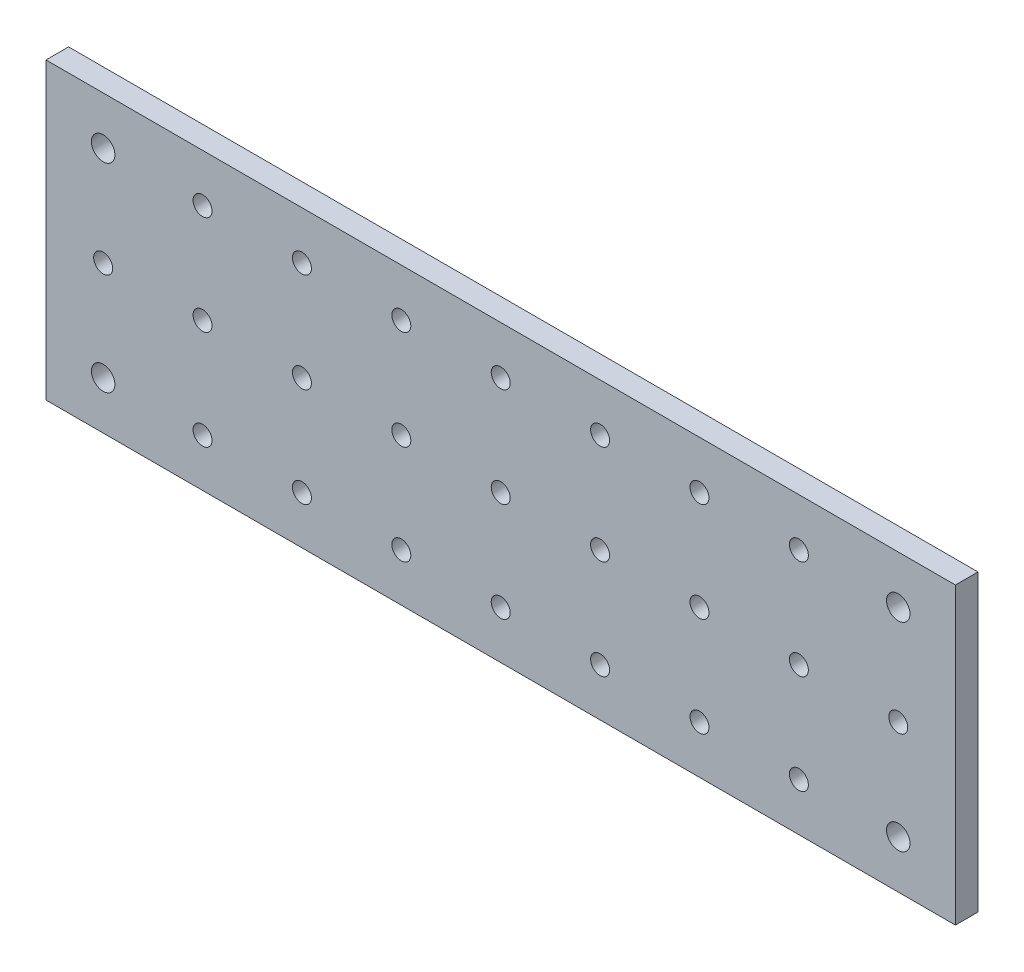
ISO-10303-21;
HEADER;
FILE_DESCRIPTION(('STEP AP214'),'2;1');
FILE_NAME('part.step','',(''),(''),'','','');
FILE_SCHEMA(('AUTOMOTIVE_DESIGN { 1 0 10303 214 1 1 1 1 }'));
ENDSEC;
DATA;
#1=APPLICATION_CONTEXT('core data for automotive mechanical design processes');
#2=APPLICATION_PROTOCOL_DEFINITION('international standard','automotive_design',2000,#1);
#3=PRODUCT_CONTEXT('',#1,'mechanical');
#4=PRODUCT('Part','Part','',(#3));
#5=PRODUCT_RELATED_PRODUCT_CATEGORY('part','',(#4));
#6=PRODUCT_DEFINITION_FORMATION('','',#4);
#7=PRODUCT_DEFINITION_CONTEXT('part definition',#1,'design');
#8=PRODUCT_DEFINITION('design','',#6,#7);
#9=PRODUCT_DEFINITION_SHAPE('','',#8);
#10=(LENGTH_UNIT() NAMED_UNIT(*) SI_UNIT(.MILLI.,.METRE.));
#11=(NAMED_UNIT(*) PLANE_ANGLE_UNIT() SI_UNIT($,.RADIAN.));
#12=(NAMED_UNIT(*) SI_UNIT($,.STERADIAN.) SOLID_ANGLE_UNIT());
#13=UNCERTAINTY_MEASURE_WITH_UNIT(LENGTH_MEASURE(1.E-05),#10,'distance_accuracy_value','');
#14=(GEOMETRIC_REPRESENTATION_CONTEXT(3) GLOBAL_UNCERTAINTY_ASSIGNED_CONTEXT((#13)) GLOBAL_UNIT_ASSIGNED_CONTEXT((#10,
#11,#12)) REPRESENTATION_CONTEXT('',''));
#15=CARTESIAN_POINT('',(0.,0.,0.));
#16=DIRECTION('',(0.,0.,1.));
#17=DIRECTION('',(1.,0.,0.));
#18=AXIS2_PLACEMENT_3D('',#15,#16,#17);
#19=CARTESIAN_POINT('',(0.,0.,5.));
#20=DIRECTION('',(0.,0.,-1.));
#21=DIRECTION('',(-1.,0.,0.));
#22=AXIS2_PLACEMENT_3D('',#19,#20,#21);
#23=PLANE('',#22);
#24=CARTESIAN_POINT('',(12.6500000000002,10.5999999999994,5.));
#25=DIRECTION('',(0.,0.,-1.));
#26=DIRECTION('',(-1.,0.,0.));
#27=AXIS2_PLACEMENT_3D('',#24,#25,#26);
#28=CIRCLE('',#27,2.6);
#29=CARTESIAN_POINT('',(10.0500000000002,10.5999999999994,5.));
#30=VERTEX_POINT('',#29);
#31=EDGE_CURVE('E116',#30,#30,#28,.F.);
#32=ORIENTED_EDGE('',*,*,#31,.F.);
#33=EDGE_LOOP('',(#32));
#34=FACE_BOUND('',#33,.T.);
#35=CARTESIAN_POINT('',(188.65,54.6,5.));
#36=DIRECTION('',(0.,0.,-1.));
#37=DIRECTION('',(-1.,0.,0.));
#38=AXIS2_PLACEMENT_3D('',#35,#36,#37);
#39=CIRCLE('',#38,2.59999999999999);
#40=CARTESIAN_POINT('',(186.05,54.6,5.));
#41=VERTEX_POINT('',#40);
#42=EDGE_CURVE('E112',#41,#41,#39,.F.);
#43=ORIENTED_EDGE('',*,*,#42,.F.);
#44=EDGE_LOOP('',(#43));
#45=FACE_BOUND('',#44,.T.);
#46=CARTESIAN_POINT('',(34.6500000000002,10.5999999999995,5.));
#47=DIRECTION('',(0.,0.,-1.));
#48=DIRECTION('',(-1.,0.,0.));
#49=AXIS2_PLACEMENT_3D('',#46,#47,#48);
#50=CIRCLE('',#49,2.1);
#51=CARTESIAN_POINT('',(32.5500000000002,10.5999999999995,5.));
#52=VERTEX_POINT('',#51);
#53=EDGE_CURVE('E143',#52,#52,#50,.F.);
#54=ORIENTED_EDGE('',*,*,#53,.F.);
#55=EDGE_LOOP('',(#54));
#56=FACE_BOUND('',#55,.T.);
#57=CARTESIAN_POINT('',(34.65,32.5999999999995,5.));
#58=DIRECTION('',(0.,0.,-1.));
#59=DIRECTION('',(-1.,0.,0.));
#60=AXIS2_PLACEMENT_3D('',#57,#58,#59);
#61=CIRCLE('',#60,2.1);
#62=CARTESIAN_POINT('',(32.55,32.5999999999995,5.));
#63=VERTEX_POINT('',#62);
#64=EDGE_CURVE('E155',#63,#63,#61,.F.);
#65=ORIENTED_EDGE('',*,*,#64,.F.);
#66=EDGE_LOOP('',(#65));
#67=FACE_BOUND('',#66,.T.);
#68=CARTESIAN_POINT('',(56.6499999999999,54.5999999999997,5.));
#69=DIRECTION('',(0.,0.,-1.));
#70=DIRECTION('',(-1.,0.,0.));
#71=AXIS2_PLACEMENT_3D('',#68,#69,#70);
#72=CIRCLE('',#71,2.1);
#73=CARTESIAN_POINT('',(54.5499999999999,54.5999999999997,5.));
#74=VERTEX_POINT('',#73);
#75=EDGE_CURVE('E167',#74,#74,#72,.F.);
#76=ORIENTED_EDGE('',*,*,#75,.F.);
#77=EDGE_LOOP('',(#76));
#78=FACE_BOUND('',#77,.T.);
#79=CARTESIAN_POINT('',(78.6500000000002,10.5999999999999,5.));
#80=DIRECTION('',(0.,0.,-1.));
#81=DIRECTION('',(-1.,0.,0.));
#82=AXIS2_PLACEMENT_3D('',#79,#80,#81);
#83=CIRCLE('',#82,2.09999999999999);
#84=CARTESIAN_POINT('',(76.5500000000003,10.5999999999999,5.));
#85=VERTEX_POINT('',#84);
#86=EDGE_CURVE('E179',#85,#85,#83,.F.);
#87=ORIENTED_EDGE('',*,*,#86,.F.);
#88=EDGE_LOOP('',(#87));
#89=FACE_BOUND('',#88,.T.);
#90=CARTESIAN_POINT('',(78.65,32.5999999999999,5.));
#91=DIRECTION('',(0.,0.,-1.));
#92=DIRECTION('',(-1.,0.,0.));
#93=AXIS2_PLACEMENT_3D('',#90,#91,#92);
#94=CIRCLE('',#93,2.10000000000002);
#95=CARTESIAN_POINT('',(76.55,32.5999999999999,5.));
#96=VERTEX_POINT('',#95);
#97=EDGE_CURVE('E191',#96,#96,#94,.F.);
#98=ORIENTED_EDGE('',*,*,#97,.F.);
#99=EDGE_LOOP('',(#98));
#100=FACE_BOUND('',#99,.T.);
#101=CARTESIAN_POINT('',(166.65,10.6,5.));
#102=DIRECTION('',(0.,0.,-1.));
#103=DIRECTION('',(-1.,0.,0.));
#104=AXIS2_PLACEMENT_3D('',#101,#102,#103);
#105=CIRCLE('',#104,2.09999999999999);
#106=CARTESIAN_POINT('',(164.55,10.6,5.));
#107=VERTEX_POINT('',#106);
#108=EDGE_CURVE('E203',#107,#107,#105,.F.);
#109=ORIENTED_EDGE('',*,*,#108,.F.);
#110=EDGE_LOOP('',(#109));
#111=FACE_BOUND('',#110,.T.);
#112=CARTESIAN_POINT('',(166.65,32.6,5.));
#113=DIRECTION('',(0.,0.,-1.));
#114=DIRECTION('',(-1.,0.,0.));
#115=AXIS2_PLACEMENT_3D('',#112,#113,#114);
#116=CIRCLE('',#115,2.09999999999999);
#117=CARTESIAN_POINT('',(164.55,32.6,5.));
#118=VERTEX_POINT('',#117);
#119=EDGE_CURVE('E215',#118,#118,#116,.F.);
#120=ORIENTED_EDGE('',*,*,#119,.F.);
#121=EDGE_LOOP('',(#120));
#122=FACE_BOUND('',#121,.T.);
#123=CARTESIAN_POINT('',(144.65,54.6,5.));
#124=DIRECTION('',(0.,0.,-1.));
#125=DIRECTION('',(-1.,0.,0.));
#126=AXIS2_PLACEMENT_3D('',#123,#124,#125);
#127=CIRCLE('',#126,2.10000000000002);
#128=CARTESIAN_POINT('',(142.55,54.6,5.));
#129=VERTEX_POINT('',#128);
#130=EDGE_CURVE('E227',#129,#129,#127,.F.);
#131=ORIENTED_EDGE('',*,*,#130,.F.);
#132=EDGE_LOOP('',(#131));
#133=FACE_BOUND('',#132,.T.);
#134=CARTESIAN_POINT('',(122.65,10.6,5.));
#135=DIRECTION('',(0.,0.,-1.));
#136=DIRECTION('',(-1.,0.,0.));
#137=AXIS2_PLACEMENT_3D('',#134,#135,#136);
#138=CIRCLE('',#137,2.10000000000002);
#139=CARTESIAN_POINT('',(120.55,10.6,5.));
#140=VERTEX_POINT('',#139);
#141=EDGE_CURVE('E239',#140,#140,#138,.F.);
#142=ORIENTED_EDGE('',*,*,#141,.F.);
#143=EDGE_LOOP('',(#142));
#144=FACE_BOUND('',#143,.T.);
#145=CARTESIAN_POINT('',(122.65,32.6,5.));
#146=DIRECTION('',(0.,0.,-1.));
#147=DIRECTION('',(-1.,0.,0.));
#148=AXIS2_PLACEMENT_3D('',#145,#146,#147);
#149=CIRCLE('',#148,2.09999999999999);
#150=CARTESIAN_POINT('',(120.55,32.6,5.));
#151=VERTEX_POINT('',#150);
#152=EDGE_CURVE('E251',#151,#151,#149,.F.);
#153=ORIENTED_EDGE('',*,*,#152,.F.);
#154=EDGE_LOOP('',(#153));
#155=FACE_BOUND('',#154,.T.);
#156=CARTESIAN_POINT('',(100.65,54.6,5.));
#157=DIRECTION('',(0.,0.,-1.));
#158=DIRECTION('',(-1.,0.,0.));
#159=AXIS2_PLACEMENT_3D('',#156,#157,#158);
#160=CIRCLE('',#159,2.1);
#161=CARTESIAN_POINT('',(98.5499999999999,54.6,5.));
#162=VERTEX_POINT('',#161);
#163=EDGE_CURVE('E263',#162,#162,#160,.F.);
#164=ORIENTED_EDGE('',*,*,#163,.F.);
#165=EDGE_LOOP('',(#164));
#166=FACE_BOUND('',#165,.T.);
#167=DIRECTION('',(0.,-1.,0.));
#168=VECTOR('',#167,1.);
#169=CARTESIAN_POINT('',(0.,0.,5.));
#170=LINE('',#169,#168);
#171=CARTESIAN_POINT('',(0.,65.2,5.));
#172=VERTEX_POINT('',#171);
#173=CARTESIAN_POINT('',(0.,0.,5.));
#174=VERTEX_POINT('',#173);
#175=EDGE_CURVE('E87',#172,#174,#170,.T.);
#176=ORIENTED_EDGE('',*,*,#175,.T.);
#177=DIRECTION('',(1.,0.,0.));
#178=VECTOR('',#177,1.);
#179=CARTESIAN_POINT('',(0.,0.,5.));
#180=LINE('',#179,#178);
#181=CARTESIAN_POINT('',(201.3,0.,5.));
#182=VERTEX_POINT('',#181);
#183=EDGE_CURVE('E82',#174,#182,#180,.T.);
#184=ORIENTED_EDGE('',*,*,#183,.T.);
#185=DIRECTION('',(0.,1.,0.));
#186=VECTOR('',#185,1.);
#187=CARTESIAN_POINT('',(201.3,0.,5.));
#188=LINE('',#187,#186);
#189=CARTESIAN_POINT('',(201.3,65.2,5.));
#190=VERTEX_POINT('',#189);
#191=EDGE_CURVE('E85',#182,#190,#188,.T.);
#192=ORIENTED_EDGE('',*,*,#191,.T.);
#193=DIRECTION('',(-1.,0.,0.));
#194=VECTOR('',#193,1.);
#195=CARTESIAN_POINT('',(0.,65.2,5.));
#196=LINE('',#195,#194);
#197=EDGE_CURVE('E52',#190,#172,#196,.T.);
#198=ORIENTED_EDGE('',*,*,#197,.T.);
#199=EDGE_LOOP('',(#176,#184,#192,#198));
#200=FACE_BOUND('',#199,.T.);
#201=CARTESIAN_POINT('',(100.65,32.6,5.));
#202=DIRECTION('',(0.,0.,-1.));
#203=DIRECTION('',(-1.,0.,0.));
#204=AXIS2_PLACEMENT_3D('',#201,#202,#203);
#205=CIRCLE('',#204,2.1);
#206=CARTESIAN_POINT('',(98.55,32.6,5.));
#207=VERTEX_POINT('',#206);
#208=EDGE_CURVE('E103',#207,#207,#205,.F.);
#209=ORIENTED_EDGE('',*,*,#208,.F.);
#210=EDGE_LOOP('',(#209));
#211=FACE_BOUND('',#210,.T.);
#212=CARTESIAN_POINT('',(100.65,10.6,5.));
#213=DIRECTION('',(0.,0.,-1.));
#214=DIRECTION('',(-1.,0.,0.));
#215=AXIS2_PLACEMENT_3D('',#212,#213,#214);
#216=CIRCLE('',#215,2.1);
#217=CARTESIAN_POINT('',(98.5500000000002,10.6,5.));
#218=VERTEX_POINT('',#217);
#219=EDGE_CURVE('E257',#218,#218,#216,.F.);
#220=ORIENTED_EDGE('',*,*,#219,.F.);
#221=EDGE_LOOP('',(#220));
#222=FACE_BOUND('',#221,.T.);
#223=CARTESIAN_POINT('',(122.65,54.6,5.));
#224=DIRECTION('',(0.,0.,-1.));
#225=DIRECTION('',(-1.,0.,0.));
#226=AXIS2_PLACEMENT_3D('',#223,#224,#225);
#227=CIRCLE('',#226,2.09999999999999);
#228=CARTESIAN_POINT('',(120.55,54.6,5.));
#229=VERTEX_POINT('',#228);
#230=EDGE_CURVE('E245',#229,#229,#227,.F.);
#231=ORIENTED_EDGE('',*,*,#230,.F.);
#232=EDGE_LOOP('',(#231));
#233=FACE_BOUND('',#232,.T.);
#234=CARTESIAN_POINT('',(144.65,32.6,5.));
#235=DIRECTION('',(0.,0.,-1.));
#236=DIRECTION('',(-1.,0.,0.));
#237=AXIS2_PLACEMENT_3D('',#234,#235,#236);
#238=CIRCLE('',#237,2.09999999999999);
#239=CARTESIAN_POINT('',(142.55,32.6,5.));
#240=VERTEX_POINT('',#239);
#241=EDGE_CURVE('E233',#240,#240,#238,.F.);
#242=ORIENTED_EDGE('',*,*,#241,.F.);
#243=EDGE_LOOP('',(#242));
#244=FACE_BOUND('',#243,.T.);
#245=CARTESIAN_POINT('',(144.65,10.6,5.));
#246=DIRECTION('',(0.,0.,-1.));
#247=DIRECTION('',(-1.,0.,0.));
#248=AXIS2_PLACEMENT_3D('',#245,#246,#247);
#249=CIRCLE('',#248,2.10000000000002);
#250=CARTESIAN_POINT('',(142.55,10.6,5.));
#251=VERTEX_POINT('',#250);
#252=EDGE_CURVE('E221',#251,#251,#249,.F.);
#253=ORIENTED_EDGE('',*,*,#252,.F.);
#254=EDGE_LOOP('',(#253));
#255=FACE_BOUND('',#254,.T.);
#256=CARTESIAN_POINT('',(166.65,54.6,5.));
#257=DIRECTION('',(0.,0.,-1.));
#258=DIRECTION('',(-1.,0.,0.));
#259=AXIS2_PLACEMENT_3D('',#256,#257,#258);
#260=CIRCLE('',#259,2.10000000000002);
#261=CARTESIAN_POINT('',(164.55,54.6,5.));
#262=VERTEX_POINT('',#261);
#263=EDGE_CURVE('E209',#262,#262,#260,.F.);
#264=ORIENTED_EDGE('',*,*,#263,.F.);
#265=EDGE_LOOP('',(#264));
#266=FACE_BOUND('',#265,.T.);
#267=CARTESIAN_POINT('',(188.65,32.6,5.));
#268=DIRECTION('',(0.,0.,-1.));
#269=DIRECTION('',(-1.,0.,0.));
#270=AXIS2_PLACEMENT_3D('',#267,#268,#269);
#271=CIRCLE('',#270,2.10000000000002);
#272=CARTESIAN_POINT('',(186.55,32.6,5.));
#273=VERTEX_POINT('',#272);
#274=EDGE_CURVE('E197',#273,#273,#271,.F.);
#275=ORIENTED_EDGE('',*,*,#274,.F.);
#276=EDGE_LOOP('',(#275));
#277=FACE_BOUND('',#276,.T.);
#278=CARTESIAN_POINT('',(78.6499999999999,54.5999999999999,5.));
#279=DIRECTION('',(0.,0.,-1.));
#280=DIRECTION('',(-1.,0.,0.));
#281=AXIS2_PLACEMENT_3D('',#278,#279,#280);
#282=CIRCLE('',#281,2.10000000000002);
#283=CARTESIAN_POINT('',(76.5499999999999,54.5999999999999,5.));
#284=VERTEX_POINT('',#283);
#285=EDGE_CURVE('E185',#284,#284,#282,.F.);
#286=ORIENTED_EDGE('',*,*,#285,.F.);
#287=EDGE_LOOP('',(#286));
#288=FACE_BOUND('',#287,.T.);
#289=CARTESIAN_POINT('',(56.65,32.5999999999997,5.));
#290=DIRECTION('',(0.,0.,-1.));
#291=DIRECTION('',(-1.,0.,0.));
#292=AXIS2_PLACEMENT_3D('',#289,#290,#291);
#293=CIRCLE('',#292,2.1);
#294=CARTESIAN_POINT('',(54.55,32.5999999999997,5.));
#295=VERTEX_POINT('',#294);
#296=EDGE_CURVE('E173',#295,#295,#293,.F.);
#297=ORIENTED_EDGE('',*,*,#296,.F.);
#298=EDGE_LOOP('',(#297));
#299=FACE_BOUND('',#298,.T.);
#300=CARTESIAN_POINT('',(56.6500000000002,10.5999999999997,5.));
#301=DIRECTION('',(0.,0.,-1.));
#302=DIRECTION('',(-1.,0.,0.));
#303=AXIS2_PLACEMENT_3D('',#300,#301,#302);
#304=CIRCLE('',#303,2.1);
#305=CARTESIAN_POINT('',(54.5500000000002,10.5999999999997,5.));
#306=VERTEX_POINT('',#305);
#307=EDGE_CURVE('E161',#306,#306,#304,.F.);
#308=ORIENTED_EDGE('',*,*,#307,.F.);
#309=EDGE_LOOP('',(#308));
#310=FACE_BOUND('',#309,.T.);
#311=CARTESIAN_POINT('',(34.6499999999999,54.5999999999995,5.));
#312=DIRECTION('',(0.,0.,-1.));
#313=DIRECTION('',(-1.,0.,0.));
#314=AXIS2_PLACEMENT_3D('',#311,#312,#313);
#315=CIRCLE('',#314,2.1);
#316=CARTESIAN_POINT('',(32.5499999999999,54.5999999999995,5.));
#317=VERTEX_POINT('',#316);
#318=EDGE_CURVE('E149',#317,#317,#315,.F.);
#319=ORIENTED_EDGE('',*,*,#318,.F.);
#320=EDGE_LOOP('',(#319));
#321=FACE_BOUND('',#320,.T.);
#322=CARTESIAN_POINT('',(12.65,32.5999999999994,5.));
#323=DIRECTION('',(0.,0.,-1.));
#324=DIRECTION('',(-1.,0.,0.));
#325=AXIS2_PLACEMENT_3D('',#322,#323,#324);
#326=CIRCLE('',#325,2.1);
#327=CARTESIAN_POINT('',(10.55,32.5999999999994,5.));
#328=VERTEX_POINT('',#327);
#329=EDGE_CURVE('E137',#328,#328,#326,.F.);
#330=ORIENTED_EDGE('',*,*,#329,.F.);
#331=EDGE_LOOP('',(#330));
#332=FACE_BOUND('',#331,.T.);
#333=CARTESIAN_POINT('',(12.6500000000006,54.5999999999997,5.));
#334=DIRECTION('',(0.,0.,-1.));
#335=DIRECTION('',(-1.,0.,0.));
#336=AXIS2_PLACEMENT_3D('',#333,#334,#335);
#337=CIRCLE('',#336,2.6);
#338=CARTESIAN_POINT('',(10.0500000000006,54.5999999999997,5.));
#339=VERTEX_POINT('',#338);
#340=EDGE_CURVE('E113',#339,#339,#337,.F.);
#341=ORIENTED_EDGE('',*,*,#340,.F.);
#342=EDGE_LOOP('',(#341));
#343=FACE_BOUND('',#342,.T.);
#344=CARTESIAN_POINT('',(188.65,10.6,5.));
#345=DIRECTION('',(0.,0.,-1.));
#346=DIRECTION('',(-1.,0.,0.));
#347=AXIS2_PLACEMENT_3D('',#344,#345,#346);
#348=CIRCLE('',#347,2.59999999999999);
#349=CARTESIAN_POINT('',(186.05,10.6,5.));
#350=VERTEX_POINT('',#349);
#351=EDGE_CURVE('E119',#350,#350,#348,.F.);
#352=ORIENTED_EDGE('',*,*,#351,.F.);
#353=EDGE_LOOP('',(#352));
#354=FACE_BOUND('',#353,.T.);
#355=ADVANCED_FACE('F33',(#34,#45,#56,#67,#78,#89,#100,#111,#122,#133,#144,#155,#166,#200,#211,
#222,#233,#244,#255,#266,#277,#288,#299,#310,#321,#332,#343,#354),#23,.F.);
#356=CARTESIAN_POINT('',(0.,0.,0.));
#357=DIRECTION('',(0.,0.,-1.));
#358=DIRECTION('',(-1.,0.,0.));
#359=AXIS2_PLACEMENT_3D('',#356,#357,#358);
#360=PLANE('',#359);
#361=CARTESIAN_POINT('',(12.6500000000002,10.5999999999994,0.));
#362=DIRECTION('',(0.,0.,-1.));
#363=DIRECTION('',(-1.,0.,0.));
#364=AXIS2_PLACEMENT_3D('',#361,#362,#363);
#365=CIRCLE('',#364,2.6);
#366=CARTESIAN_POINT('',(10.0500000000002,10.5999999999994,0.));
#367=VERTEX_POINT('',#366);
#368=EDGE_CURVE('E117',#367,#367,#365,.F.);
#369=ORIENTED_EDGE('',*,*,#368,.T.);
#370=EDGE_LOOP('',(#369));
#371=FACE_BOUND('',#370,.T.);
#372=CARTESIAN_POINT('',(188.65,54.6,0.));
#373=DIRECTION('',(0.,0.,-1.));
#374=DIRECTION('',(-1.,0.,0.));
#375=AXIS2_PLACEMENT_3D('',#372,#373,#374);
#376=CIRCLE('',#375,2.59999999999999);
#377=CARTESIAN_POINT('',(186.05,54.6,0.));
#378=VERTEX_POINT('',#377);
#379=EDGE_CURVE('E109',#378,#378,#376,.F.);
#380=ORIENTED_EDGE('',*,*,#379,.T.);
#381=EDGE_LOOP('',(#380));
#382=FACE_BOUND('',#381,.T.);
#383=CARTESIAN_POINT('',(34.6500000000002,10.5999999999995,0.));
#384=DIRECTION('',(0.,0.,1.));
#385=DIRECTION('',(1.,0.,0.));
#386=AXIS2_PLACEMENT_3D('',#383,#384,#385);
#387=CIRCLE('',#386,2.1);
#388=CARTESIAN_POINT('',(36.7500000000002,10.5999999999995,0.));
#389=VERTEX_POINT('',#388);
#390=EDGE_CURVE('E140',#389,#389,#387,.T.);
#391=ORIENTED_EDGE('',*,*,#390,.T.);
#392=EDGE_LOOP('',(#391));
#393=FACE_BOUND('',#392,.T.);
#394=CARTESIAN_POINT('',(34.65,32.5999999999995,0.));
#395=DIRECTION('',(0.,0.,1.));
#396=DIRECTION('',(1.,0.,0.));
#397=AXIS2_PLACEMENT_3D('',#394,#395,#396);
#398=CIRCLE('',#397,2.1);
#399=CARTESIAN_POINT('',(36.75,32.5999999999995,0.));
#400=VERTEX_POINT('',#399);
#401=EDGE_CURVE('E152',#400,#400,#398,.T.);
#402=ORIENTED_EDGE('',*,*,#401,.T.);
#403=EDGE_LOOP('',(#402));
#404=FACE_BOUND('',#403,.T.);
#405=CARTESIAN_POINT('',(56.6499999999999,54.5999999999997,0.));
#406=DIRECTION('',(0.,0.,1.));
#407=DIRECTION('',(1.,0.,0.));
#408=AXIS2_PLACEMENT_3D('',#405,#406,#407);
#409=CIRCLE('',#408,2.1);
#410=CARTESIAN_POINT('',(58.7499999999999,54.5999999999997,0.));
#411=VERTEX_POINT('',#410);
#412=EDGE_CURVE('E164',#411,#411,#409,.T.);
#413=ORIENTED_EDGE('',*,*,#412,.T.);
#414=EDGE_LOOP('',(#413));
#415=FACE_BOUND('',#414,.T.);
#416=CARTESIAN_POINT('',(78.6500000000002,10.5999999999999,0.));
#417=DIRECTION('',(0.,0.,1.));
#418=DIRECTION('',(1.,0.,0.));
#419=AXIS2_PLACEMENT_3D('',#416,#417,#418);
#420=CIRCLE('',#419,2.09999999999999);
#421=CARTESIAN_POINT('',(80.7500000000002,10.5999999999999,0.));
#422=VERTEX_POINT('',#421);
#423=EDGE_CURVE('E176',#422,#422,#420,.T.);
#424=ORIENTED_EDGE('',*,*,#423,.T.);
#425=EDGE_LOOP('',(#424));
#426=FACE_BOUND('',#425,.T.);
#427=CARTESIAN_POINT('',(78.65,32.5999999999999,0.));
#428=DIRECTION('',(0.,0.,1.));
#429=DIRECTION('',(1.,0.,0.));
#430=AXIS2_PLACEMENT_3D('',#427,#428,#429);
#431=CIRCLE('',#430,2.10000000000002);
#432=CARTESIAN_POINT('',(80.75,32.5999999999999,0.));
#433=VERTEX_POINT('',#432);
#434=EDGE_CURVE('E188',#433,#433,#431,.T.);
#435=ORIENTED_EDGE('',*,*,#434,.T.);
#436=EDGE_LOOP('',(#435));
#437=FACE_BOUND('',#436,.T.);
#438=CARTESIAN_POINT('',(166.65,10.6,0.));
#439=DIRECTION('',(0.,0.,1.));
#440=DIRECTION('',(1.,0.,0.));
#441=AXIS2_PLACEMENT_3D('',#438,#439,#440);
#442=CIRCLE('',#441,2.09999999999999);
#443=CARTESIAN_POINT('',(168.75,10.6,0.));
#444=VERTEX_POINT('',#443);
#445=EDGE_CURVE('E200',#444,#444,#442,.T.);
#446=ORIENTED_EDGE('',*,*,#445,.T.);
#447=EDGE_LOOP('',(#446));
#448=FACE_BOUND('',#447,.T.);
#449=CARTESIAN_POINT('',(166.65,32.6,0.));
#450=DIRECTION('',(0.,0.,1.));
#451=DIRECTION('',(1.,0.,0.));
#452=AXIS2_PLACEMENT_3D('',#449,#450,#451);
#453=CIRCLE('',#452,2.09999999999999);
#454=CARTESIAN_POINT('',(168.75,32.6,0.));
#455=VERTEX_POINT('',#454);
#456=EDGE_CURVE('E212',#455,#455,#453,.T.);
#457=ORIENTED_EDGE('',*,*,#456,.T.);
#458=EDGE_LOOP('',(#457));
#459=FACE_BOUND('',#458,.T.);
#460=CARTESIAN_POINT('',(144.65,54.6,0.));
#461=DIRECTION('',(0.,0.,1.));
#462=DIRECTION('',(1.,0.,0.));
#463=AXIS2_PLACEMENT_3D('',#460,#461,#462);
#464=CIRCLE('',#463,2.10000000000002);
#465=CARTESIAN_POINT('',(146.75,54.6,0.));
#466=VERTEX_POINT('',#465);
#467=EDGE_CURVE('E224',#466,#466,#464,.T.);
#468=ORIENTED_EDGE('',*,*,#467,.T.);
#469=EDGE_LOOP('',(#468));
#470=FACE_BOUND('',#469,.T.);
#471=CARTESIAN_POINT('',(122.65,10.6,0.));
#472=DIRECTION('',(0.,0.,1.));
#473=DIRECTION('',(1.,0.,0.));
#474=AXIS2_PLACEMENT_3D('',#471,#472,#473);
#475=CIRCLE('',#474,2.10000000000002);
#476=CARTESIAN_POINT('',(124.75,10.6,0.));
#477=VERTEX_POINT('',#476);
#478=EDGE_CURVE('E236',#477,#477,#475,.T.);
#479=ORIENTED_EDGE('',*,*,#478,.T.);
#480=EDGE_LOOP('',(#479));
#481=FACE_BOUND('',#480,.T.);
#482=CARTESIAN_POINT('',(122.65,32.6,0.));
#483=DIRECTION('',(0.,0.,1.));
#484=DIRECTION('',(1.,0.,0.));
#485=AXIS2_PLACEMENT_3D('',#482,#483,#484);
#486=CIRCLE('',#485,2.09999999999999);
#487=CARTESIAN_POINT('',(124.75,32.6,0.));
#488=VERTEX_POINT('',#487);
#489=EDGE_CURVE('E248',#488,#488,#486,.T.);
#490=ORIENTED_EDGE('',*,*,#489,.T.);
#491=EDGE_LOOP('',(#490));
#492=FACE_BOUND('',#491,.T.);
#493=CARTESIAN_POINT('',(100.65,54.6,0.));
#494=DIRECTION('',(0.,0.,1.));
#495=DIRECTION('',(1.,0.,0.));
#496=AXIS2_PLACEMENT_3D('',#493,#494,#495);
#497=CIRCLE('',#496,2.1);
#498=CARTESIAN_POINT('',(102.75,54.6,0.));
#499=VERTEX_POINT('',#498);
#500=EDGE_CURVE('E260',#499,#499,#497,.T.);
#501=ORIENTED_EDGE('',*,*,#500,.T.);
#502=EDGE_LOOP('',(#501));
#503=FACE_BOUND('',#502,.T.);
#504=DIRECTION('',(0.,-1.,0.));
#505=VECTOR('',#504,1.);
#506=CARTESIAN_POINT('',(0.,0.,0.));
#507=LINE('',#506,#505);
#508=CARTESIAN_POINT('',(0.,65.2,0.));
#509=VERTEX_POINT('',#508);
#510=CARTESIAN_POINT('',(0.,0.,0.));
#511=VERTEX_POINT('',#510);
#512=EDGE_CURVE('E100',#509,#511,#507,.T.);
#513=ORIENTED_EDGE('',*,*,#512,.F.);
#514=DIRECTION('',(-1.,0.,0.));
#515=VECTOR('',#514,1.);
#516=CARTESIAN_POINT('',(0.,65.2,0.));
#517=LINE('',#516,#515);
#518=CARTESIAN_POINT('',(201.3,65.2,0.));
#519=VERTEX_POINT('',#518);
#520=EDGE_CURVE('E75',#519,#509,#517,.T.);
#521=ORIENTED_EDGE('',*,*,#520,.F.);
#522=DIRECTION('',(0.,1.,0.));
#523=VECTOR('',#522,1.);
#524=CARTESIAN_POINT('',(201.3,0.,0.));
#525=LINE('',#524,#523);
#526=CARTESIAN_POINT('',(201.3,0.,0.));
#527=VERTEX_POINT('',#526);
#528=EDGE_CURVE('E69',#527,#519,#525,.T.);
#529=ORIENTED_EDGE('',*,*,#528,.F.);
#530=DIRECTION('',(1.,0.,0.));
#531=VECTOR('',#530,1.);
#532=CARTESIAN_POINT('',(0.,0.,0.));
#533=LINE('',#532,#531);
#534=EDGE_CURVE('E91',#511,#527,#533,.T.);
#535=ORIENTED_EDGE('',*,*,#534,.F.);
#536=EDGE_LOOP('',(#513,#521,#529,#535));
#537=FACE_BOUND('',#536,.T.);
#538=CARTESIAN_POINT('',(100.65,32.6,0.));
#539=DIRECTION('',(0.,0.,1.));
#540=DIRECTION('',(1.,0.,0.));
#541=AXIS2_PLACEMENT_3D('',#538,#539,#540);
#542=CIRCLE('',#541,2.1);
#543=CARTESIAN_POINT('',(102.75,32.6,0.));
#544=VERTEX_POINT('',#543);
#545=EDGE_CURVE('E266',#544,#544,#542,.T.);
#546=ORIENTED_EDGE('',*,*,#545,.T.);
#547=EDGE_LOOP('',(#546));
#548=FACE_BOUND('',#547,.T.);
#549=CARTESIAN_POINT('',(100.65,10.6,0.));
#550=DIRECTION('',(0.,0.,1.));
#551=DIRECTION('',(1.,0.,0.));
#552=AXIS2_PLACEMENT_3D('',#549,#550,#551);
#553=CIRCLE('',#552,2.1);
#554=CARTESIAN_POINT('',(102.75,10.6,0.));
#555=VERTEX_POINT('',#554);
#556=EDGE_CURVE('E254',#555,#555,#553,.T.);
#557=ORIENTED_EDGE('',*,*,#556,.T.);
#558=EDGE_LOOP('',(#557));
#559=FACE_BOUND('',#558,.T.);
#560=CARTESIAN_POINT('',(122.65,54.6,0.));
#561=DIRECTION('',(0.,0.,1.));
#562=DIRECTION('',(1.,0.,0.));
#563=AXIS2_PLACEMENT_3D('',#560,#561,#562);
#564=CIRCLE('',#563,2.09999999999999);
#565=CARTESIAN_POINT('',(124.75,54.6,0.));
#566=VERTEX_POINT('',#565);
#567=EDGE_CURVE('E242',#566,#566,#564,.T.);
#568=ORIENTED_EDGE('',*,*,#567,.T.);
#569=EDGE_LOOP('',(#568));
#570=FACE_BOUND('',#569,.T.);
#571=CARTESIAN_POINT('',(144.65,32.6,0.));
#572=DIRECTION('',(0.,0.,1.));
#573=DIRECTION('',(1.,0.,0.));
#574=AXIS2_PLACEMENT_3D('',#571,#572,#573);
#575=CIRCLE('',#574,2.09999999999999);
#576=CARTESIAN_POINT('',(146.75,32.6,0.));
#577=VERTEX_POINT('',#576);
#578=EDGE_CURVE('E230',#577,#577,#575,.T.);
#579=ORIENTED_EDGE('',*,*,#578,.T.);
#580=EDGE_LOOP('',(#579));
#581=FACE_BOUND('',#580,.T.);
#582=CARTESIAN_POINT('',(144.65,10.6,0.));
#583=DIRECTION('',(0.,0.,1.));
#584=DIRECTION('',(1.,0.,0.));
#585=AXIS2_PLACEMENT_3D('',#582,#583,#584);
#586=CIRCLE('',#585,2.10000000000002);
#587=CARTESIAN_POINT('',(146.75,10.6,0.));
#588=VERTEX_POINT('',#587);
#589=EDGE_CURVE('E218',#588,#588,#586,.T.);
#590=ORIENTED_EDGE('',*,*,#589,.T.);
#591=EDGE_LOOP('',(#590));
#592=FACE_BOUND('',#591,.T.);
#593=CARTESIAN_POINT('',(166.65,54.6,0.));
#594=DIRECTION('',(0.,0.,1.));
#595=DIRECTION('',(1.,0.,0.));
#596=AXIS2_PLACEMENT_3D('',#593,#594,#595);
#597=CIRCLE('',#596,2.10000000000002);
#598=CARTESIAN_POINT('',(168.75,54.6,0.));
#599=VERTEX_POINT('',#598);
#600=EDGE_CURVE('E206',#599,#599,#597,.T.);
#601=ORIENTED_EDGE('',*,*,#600,.T.);
#602=EDGE_LOOP('',(#601));
#603=FACE_BOUND('',#602,.T.);
#604=CARTESIAN_POINT('',(188.65,32.6,0.));
#605=DIRECTION('',(0.,0.,1.));
#606=DIRECTION('',(1.,0.,0.));
#607=AXIS2_PLACEMENT_3D('',#604,#605,#606);
#608=CIRCLE('',#607,2.10000000000002);
#609=CARTESIAN_POINT('',(190.75,32.6,0.));
#610=VERTEX_POINT('',#609);
#611=EDGE_CURVE('E194',#610,#610,#608,.T.);
#612=ORIENTED_EDGE('',*,*,#611,.T.);
#613=EDGE_LOOP('',(#612));
#614=FACE_BOUND('',#613,.T.);
#615=CARTESIAN_POINT('',(78.6499999999999,54.5999999999999,0.));
#616=DIRECTION('',(0.,0.,1.));
#617=DIRECTION('',(1.,0.,0.));
#618=AXIS2_PLACEMENT_3D('',#615,#616,#617);
#619=CIRCLE('',#618,2.10000000000002);
#620=CARTESIAN_POINT('',(80.7499999999999,54.5999999999999,0.));
#621=VERTEX_POINT('',#620);
#622=EDGE_CURVE('E182',#621,#621,#619,.T.);
#623=ORIENTED_EDGE('',*,*,#622,.T.);
#624=EDGE_LOOP('',(#623));
#625=FACE_BOUND('',#624,.T.);
#626=CARTESIAN_POINT('',(56.65,32.5999999999997,0.));
#627=DIRECTION('',(0.,0.,1.));
#628=DIRECTION('',(1.,0.,0.));
#629=AXIS2_PLACEMENT_3D('',#626,#627,#628);
#630=CIRCLE('',#629,2.1);
#631=CARTESIAN_POINT('',(58.75,32.5999999999997,0.));
#632=VERTEX_POINT('',#631);
#633=EDGE_CURVE('E170',#632,#632,#630,.T.);
#634=ORIENTED_EDGE('',*,*,#633,.T.);
#635=EDGE_LOOP('',(#634));
#636=FACE_BOUND('',#635,.T.);
#637=CARTESIAN_POINT('',(56.6500000000002,10.5999999999997,0.));
#638=DIRECTION('',(0.,0.,1.));
#639=DIRECTION('',(1.,0.,0.));
#640=AXIS2_PLACEMENT_3D('',#637,#638,#639);
#641=CIRCLE('',#640,2.1);
#642=CARTESIAN_POINT('',(58.7500000000002,10.5999999999997,0.));
#643=VERTEX_POINT('',#642);
#644=EDGE_CURVE('E158',#643,#643,#641,.T.);
#645=ORIENTED_EDGE('',*,*,#644,.T.);
#646=EDGE_LOOP('',(#645));
#647=FACE_BOUND('',#646,.T.);
#648=CARTESIAN_POINT('',(34.6499999999999,54.5999999999995,0.));
#649=DIRECTION('',(0.,0.,1.));
#650=DIRECTION('',(1.,0.,0.));
#651=AXIS2_PLACEMENT_3D('',#648,#649,#650);
#652=CIRCLE('',#651,2.1);
#653=CARTESIAN_POINT('',(36.7499999999999,54.5999999999995,0.));
#654=VERTEX_POINT('',#653);
#655=EDGE_CURVE('E146',#654,#654,#652,.T.);
#656=ORIENTED_EDGE('',*,*,#655,.T.);
#657=EDGE_LOOP('',(#656));
#658=FACE_BOUND('',#657,.T.);
#659=CARTESIAN_POINT('',(12.65,32.5999999999994,0.));
#660=DIRECTION('',(0.,0.,1.));
#661=DIRECTION('',(1.,0.,0.));
#662=AXIS2_PLACEMENT_3D('',#659,#660,#661);
#663=CIRCLE('',#662,2.1);
#664=CARTESIAN_POINT('',(14.75,32.5999999999994,0.));
#665=VERTEX_POINT('',#664);
#666=EDGE_CURVE('E134',#665,#665,#663,.T.);
#667=ORIENTED_EDGE('',*,*,#666,.T.);
#668=EDGE_LOOP('',(#667));
#669=FACE_BOUND('',#668,.T.);
#670=CARTESIAN_POINT('',(12.6500000000006,54.5999999999997,0.));
#671=DIRECTION('',(0.,0.,-1.));
#672=DIRECTION('',(-1.,0.,0.));
#673=AXIS2_PLACEMENT_3D('',#670,#671,#672);
#674=CIRCLE('',#673,2.6);
#675=CARTESIAN_POINT('',(10.0500000000006,54.5999999999997,0.));
#676=VERTEX_POINT('',#675);
#677=EDGE_CURVE('E114',#676,#676,#674,.F.);
#678=ORIENTED_EDGE('',*,*,#677,.T.);
#679=EDGE_LOOP('',(#678));
#680=FACE_BOUND('',#679,.T.);
#681=CARTESIAN_POINT('',(188.65,10.6,0.));
#682=DIRECTION('',(0.,0.,-1.));
#683=DIRECTION('',(-1.,0.,0.));
#684=AXIS2_PLACEMENT_3D('',#681,#682,#683);
#685=CIRCLE('',#684,2.59999999999999);
#686=CARTESIAN_POINT('',(186.05,10.6,0.));
#687=VERTEX_POINT('',#686);
#688=EDGE_CURVE('E37',#687,#687,#685,.F.);
#689=ORIENTED_EDGE('',*,*,#688,.T.);
#690=EDGE_LOOP('',(#689));
#691=FACE_BOUND('',#690,.T.);
#692=ADVANCED_FACE('F275',(#371,#382,#393,#404,#415,#426,#437,#448,#459,#470,#481,#492,#503,
#537,#548,#559,#570,#581,#592,#603,#614,#625,#636,#647,#658,#669,#680,#691),#360,.T.);
#693=CARTESIAN_POINT('',(0.,0.,5.));
#694=DIRECTION('',(1.,0.,0.));
#695=DIRECTION('',(0.,1.,0.));
#696=AXIS2_PLACEMENT_3D('',#693,#694,#695);
#697=PLANE('',#696);
#698=ORIENTED_EDGE('',*,*,#512,.T.);
#699=DIRECTION('',(0.,0.,-1.));
#700=VECTOR('',#699,1.);
#701=CARTESIAN_POINT('',(0.,0.,5.));
#702=LINE('',#701,#700);
#703=EDGE_CURVE('E11',#174,#511,#702,.T.);
#704=ORIENTED_EDGE('',*,*,#703,.F.);
#705=ORIENTED_EDGE('',*,*,#175,.F.);
#706=DIRECTION('',(0.,0.,-1.));
#707=VECTOR('',#706,1.);
#708=CARTESIAN_POINT('',(0.,65.2,5.));
#709=LINE('',#708,#707);
#710=EDGE_CURVE('E96',#172,#509,#709,.T.);
#711=ORIENTED_EDGE('',*,*,#710,.T.);
#712=EDGE_LOOP('',(#698,#704,#705,#711));
#713=FACE_BOUND('',#712,.T.);
#714=ADVANCED_FACE('F35',(#713),#697,.F.);
#715=CARTESIAN_POINT('',(0.,0.,5.));
#716=DIRECTION('',(0.,1.,0.));
#717=DIRECTION('',(0.,0.,1.));
#718=AXIS2_PLACEMENT_3D('',#715,#716,#717);
#719=PLANE('',#718);
#720=ORIENTED_EDGE('',*,*,#534,.T.);
#721=DIRECTION('',(0.,0.,-1.));
#722=VECTOR('',#721,1.);
#723=CARTESIAN_POINT('',(201.3,0.,5.));
#724=LINE('',#723,#722);
#725=EDGE_CURVE('E43',#182,#527,#724,.T.);
#726=ORIENTED_EDGE('',*,*,#725,.F.);
#727=ORIENTED_EDGE('',*,*,#183,.F.);
#728=ORIENTED_EDGE('',*,*,#703,.T.);
#729=EDGE_LOOP('',(#720,#726,#727,#728));
#730=FACE_BOUND('',#729,.T.);
#731=ADVANCED_FACE('F90',(#730),#719,.F.);
#732=CARTESIAN_POINT('',(201.3,0.,5.));
#733=DIRECTION('',(-1.,0.,0.));
#734=DIRECTION('',(0.,-1.,0.));
#735=AXIS2_PLACEMENT_3D('',#732,#733,#734);
#736=PLANE('',#735);
#737=ORIENTED_EDGE('',*,*,#528,.T.);
#738=DIRECTION('',(0.,0.,-1.));
#739=VECTOR('',#738,1.);
#740=CARTESIAN_POINT('',(201.3,65.2,5.));
#741=LINE('',#740,#739);
#742=EDGE_CURVE('E92',#190,#519,#741,.T.);
#743=ORIENTED_EDGE('',*,*,#742,.F.);
#744=ORIENTED_EDGE('',*,*,#191,.F.);
#745=ORIENTED_EDGE('',*,*,#725,.T.);
#746=EDGE_LOOP('',(#737,#743,#744,#745));
#747=FACE_BOUND('',#746,.T.);
#748=ADVANCED_FACE('F94',(#747),#736,.F.);
#749=CARTESIAN_POINT('',(0.,65.2,5.));
#750=DIRECTION('',(0.,-1.,0.));
#751=DIRECTION('',(0.,0.,-1.));
#752=AXIS2_PLACEMENT_3D('',#749,#750,#751);
#753=PLANE('',#752);
#754=ORIENTED_EDGE('',*,*,#520,.T.);
#755=ORIENTED_EDGE('',*,*,#710,.F.);
#756=ORIENTED_EDGE('',*,*,#197,.F.);
#757=ORIENTED_EDGE('',*,*,#742,.T.);
#758=EDGE_LOOP('',(#754,#755,#756,#757));
#759=FACE_BOUND('',#758,.T.);
#760=ADVANCED_FACE('F410',(#759),#753,.F.);
#761=CARTESIAN_POINT('',(100.65,32.6,30.));
#762=DIRECTION('',(0.,0.,-1.));
#763=DIRECTION('',(-1.,0.,0.));
#764=AXIS2_PLACEMENT_3D('',#761,#762,#763);
#765=CYLINDRICAL_SURFACE('',#764,2.1);
#766=ORIENTED_EDGE('',*,*,#545,.F.);
#767=EDGE_LOOP('',(#766));
#768=FACE_BOUND('',#767,.T.);
#769=ORIENTED_EDGE('',*,*,#208,.T.);
#770=EDGE_LOOP('',(#769));
#771=FACE_BOUND('',#770,.T.);
#772=ADVANCED_FACE('F272',(#768,#771),#765,.F.);
#773=CARTESIAN_POINT('',(100.65,54.6,30.));
#774=DIRECTION('',(0.,0.,-1.));
#775=DIRECTION('',(-1.,0.,0.));
#776=AXIS2_PLACEMENT_3D('',#773,#774,#775);
#777=CYLINDRICAL_SURFACE('',#776,2.1);
#778=ORIENTED_EDGE('',*,*,#500,.F.);
#779=EDGE_LOOP('',(#778));
#780=FACE_BOUND('',#779,.T.);
#781=ORIENTED_EDGE('',*,*,#163,.T.);
#782=EDGE_LOOP('',(#781));
#783=FACE_BOUND('',#782,.T.);
#784=ADVANCED_FACE('F404',(#780,#783),#777,.F.);
#785=CARTESIAN_POINT('',(100.65,10.6,30.));
#786=DIRECTION('',(0.,0.,-1.));
#787=DIRECTION('',(-1.,0.,0.));
#788=AXIS2_PLACEMENT_3D('',#785,#786,#787);
#789=CYLINDRICAL_SURFACE('',#788,2.1);
#790=ORIENTED_EDGE('',*,*,#556,.F.);
#791=EDGE_LOOP('',(#790));
#792=FACE_BOUND('',#791,.T.);
#793=ORIENTED_EDGE('',*,*,#219,.T.);
#794=EDGE_LOOP('',(#793));
#795=FACE_BOUND('',#794,.T.);
#796=ADVANCED_FACE('F400',(#792,#795),#789,.F.);
#797=CARTESIAN_POINT('',(122.65,32.6,30.));
#798=DIRECTION('',(0.,0.,-1.));
#799=DIRECTION('',(-1.,0.,0.));
#800=AXIS2_PLACEMENT_3D('',#797,#798,#799);
#801=CYLINDRICAL_SURFACE('',#800,2.09999999999999);
#802=ORIENTED_EDGE('',*,*,#489,.F.);
#803=EDGE_LOOP('',(#802));
#804=FACE_BOUND('',#803,.T.);
#805=ORIENTED_EDGE('',*,*,#152,.T.);
#806=EDGE_LOOP('',(#805));
#807=FACE_BOUND('',#806,.T.);
#808=ADVANCED_FACE('F396',(#804,#807),#801,.F.);
#809=CARTESIAN_POINT('',(122.65,54.6,30.));
#810=DIRECTION('',(0.,0.,-1.));
#811=DIRECTION('',(-1.,0.,0.));
#812=AXIS2_PLACEMENT_3D('',#809,#810,#811);
#813=CYLINDRICAL_SURFACE('',#812,2.09999999999999);
#814=ORIENTED_EDGE('',*,*,#567,.F.);
#815=EDGE_LOOP('',(#814));
#816=FACE_BOUND('',#815,.T.);
#817=ORIENTED_EDGE('',*,*,#230,.T.);
#818=EDGE_LOOP('',(#817));
#819=FACE_BOUND('',#818,.T.);
#820=ADVANCED_FACE('F392',(#816,#819),#813,.F.);
#821=CARTESIAN_POINT('',(122.65,10.6,30.));
#822=DIRECTION('',(0.,0.,-1.));
#823=DIRECTION('',(-1.,0.,0.));
#824=AXIS2_PLACEMENT_3D('',#821,#822,#823);
#825=CYLINDRICAL_SURFACE('',#824,2.10000000000002);
#826=ORIENTED_EDGE('',*,*,#478,.F.);
#827=EDGE_LOOP('',(#826));
#828=FACE_BOUND('',#827,.T.);
#829=ORIENTED_EDGE('',*,*,#141,.T.);
#830=EDGE_LOOP('',(#829));
#831=FACE_BOUND('',#830,.T.);
#832=ADVANCED_FACE('F388',(#828,#831),#825,.F.);
#833=CARTESIAN_POINT('',(144.65,32.6,30.));
#834=DIRECTION('',(0.,0.,-1.));
#835=DIRECTION('',(-1.,0.,0.));
#836=AXIS2_PLACEMENT_3D('',#833,#834,#835);
#837=CYLINDRICAL_SURFACE('',#836,2.09999999999999);
#838=ORIENTED_EDGE('',*,*,#578,.F.);
#839=EDGE_LOOP('',(#838));
#840=FACE_BOUND('',#839,.T.);
#841=ORIENTED_EDGE('',*,*,#241,.T.);
#842=EDGE_LOOP('',(#841));
#843=FACE_BOUND('',#842,.T.);
#844=ADVANCED_FACE('F384',(#840,#843),#837,.F.);
#845=CARTESIAN_POINT('',(144.65,54.6,30.));
#846=DIRECTION('',(0.,0.,-1.));
#847=DIRECTION('',(-1.,0.,0.));
#848=AXIS2_PLACEMENT_3D('',#845,#846,#847);
#849=CYLINDRICAL_SURFACE('',#848,2.10000000000002);
#850=ORIENTED_EDGE('',*,*,#467,.F.);
#851=EDGE_LOOP('',(#850));
#852=FACE_BOUND('',#851,.T.);
#853=ORIENTED_EDGE('',*,*,#130,.T.);
#854=EDGE_LOOP('',(#853));
#855=FACE_BOUND('',#854,.T.);
#856=ADVANCED_FACE('F380',(#852,#855),#849,.F.);
#857=CARTESIAN_POINT('',(144.65,10.6,30.));
#858=DIRECTION('',(0.,0.,-1.));
#859=DIRECTION('',(-1.,0.,0.));
#860=AXIS2_PLACEMENT_3D('',#857,#858,#859);
#861=CYLINDRICAL_SURFACE('',#860,2.10000000000002);
#862=ORIENTED_EDGE('',*,*,#589,.F.);
#863=EDGE_LOOP('',(#862));
#864=FACE_BOUND('',#863,.T.);
#865=ORIENTED_EDGE('',*,*,#252,.T.);
#866=EDGE_LOOP('',(#865));
#867=FACE_BOUND('',#866,.T.);
#868=ADVANCED_FACE('F376',(#864,#867),#861,.F.);
#869=CARTESIAN_POINT('',(166.65,32.6,30.));
#870=DIRECTION('',(0.,0.,-1.));
#871=DIRECTION('',(-1.,0.,0.));
#872=AXIS2_PLACEMENT_3D('',#869,#870,#871);
#873=CYLINDRICAL_SURFACE('',#872,2.09999999999999);
#874=ORIENTED_EDGE('',*,*,#456,.F.);
#875=EDGE_LOOP('',(#874));
#876=FACE_BOUND('',#875,.T.);
#877=ORIENTED_EDGE('',*,*,#119,.T.);
#878=EDGE_LOOP('',(#877));
#879=FACE_BOUND('',#878,.T.);
#880=ADVANCED_FACE('F372',(#876,#879),#873,.F.);
#881=CARTESIAN_POINT('',(166.65,54.6,30.));
#882=DIRECTION('',(0.,0.,-1.));
#883=DIRECTION('',(-1.,0.,0.));
#884=AXIS2_PLACEMENT_3D('',#881,#882,#883);
#885=CYLINDRICAL_SURFACE('',#884,2.10000000000002);
#886=ORIENTED_EDGE('',*,*,#600,.F.);
#887=EDGE_LOOP('',(#886));
#888=FACE_BOUND('',#887,.T.);
#889=ORIENTED_EDGE('',*,*,#263,.T.);
#890=EDGE_LOOP('',(#889));
#891=FACE_BOUND('',#890,.T.);
#892=ADVANCED_FACE('F368',(#888,#891),#885,.F.);
#893=CARTESIAN_POINT('',(166.65,10.6,30.));
#894=DIRECTION('',(0.,0.,-1.));
#895=DIRECTION('',(-1.,0.,0.));
#896=AXIS2_PLACEMENT_3D('',#893,#894,#895);
#897=CYLINDRICAL_SURFACE('',#896,2.09999999999999);
#898=ORIENTED_EDGE('',*,*,#445,.F.);
#899=EDGE_LOOP('',(#898));
#900=FACE_BOUND('',#899,.T.);
#901=ORIENTED_EDGE('',*,*,#108,.T.);
#902=EDGE_LOOP('',(#901));
#903=FACE_BOUND('',#902,.T.);
#904=ADVANCED_FACE('F364',(#900,#903),#897,.F.);
#905=CARTESIAN_POINT('',(188.65,32.6,30.));
#906=DIRECTION('',(0.,0.,-1.));
#907=DIRECTION('',(-1.,0.,0.));
#908=AXIS2_PLACEMENT_3D('',#905,#906,#907);
#909=CYLINDRICAL_SURFACE('',#908,2.10000000000002);
#910=ORIENTED_EDGE('',*,*,#611,.F.);
#911=EDGE_LOOP('',(#910));
#912=FACE_BOUND('',#911,.T.);
#913=ORIENTED_EDGE('',*,*,#274,.T.);
#914=EDGE_LOOP('',(#913));
#915=FACE_BOUND('',#914,.T.);
#916=ADVANCED_FACE('F360',(#912,#915),#909,.F.);
#917=CARTESIAN_POINT('',(78.65,32.5999999999999,30.));
#918=DIRECTION('',(0.,0.,-1.));
#919=DIRECTION('',(-1.,0.,0.));
#920=AXIS2_PLACEMENT_3D('',#917,#918,#919);
#921=CYLINDRICAL_SURFACE('',#920,2.10000000000002);
#922=ORIENTED_EDGE('',*,*,#434,.F.);
#923=EDGE_LOOP('',(#922));
#924=FACE_BOUND('',#923,.T.);
#925=ORIENTED_EDGE('',*,*,#97,.T.);
#926=EDGE_LOOP('',(#925));
#927=FACE_BOUND('',#926,.T.);
#928=ADVANCED_FACE('F356',(#924,#927),#921,.F.);
#929=CARTESIAN_POINT('',(78.6499999999999,54.5999999999999,30.));
#930=DIRECTION('',(0.,0.,-1.));
#931=DIRECTION('',(-1.,0.,0.));
#932=AXIS2_PLACEMENT_3D('',#929,#930,#931);
#933=CYLINDRICAL_SURFACE('',#932,2.10000000000002);
#934=ORIENTED_EDGE('',*,*,#622,.F.);
#935=EDGE_LOOP('',(#934));
#936=FACE_BOUND('',#935,.T.);
#937=ORIENTED_EDGE('',*,*,#285,.T.);
#938=EDGE_LOOP('',(#937));
#939=FACE_BOUND('',#938,.T.);
#940=ADVANCED_FACE('F352',(#936,#939),#933,.F.);
#941=CARTESIAN_POINT('',(78.6500000000002,10.5999999999999,30.));
#942=DIRECTION('',(0.,0.,-1.));
#943=DIRECTION('',(-1.,0.,0.));
#944=AXIS2_PLACEMENT_3D('',#941,#942,#943);
#945=CYLINDRICAL_SURFACE('',#944,2.09999999999999);
#946=ORIENTED_EDGE('',*,*,#423,.F.);
#947=EDGE_LOOP('',(#946));
#948=FACE_BOUND('',#947,.T.);
#949=ORIENTED_EDGE('',*,*,#86,.T.);
#950=EDGE_LOOP('',(#949));
#951=FACE_BOUND('',#950,.T.);
#952=ADVANCED_FACE('F348',(#948,#951),#945,.F.);
#953=CARTESIAN_POINT('',(56.65,32.5999999999997,30.));
#954=DIRECTION('',(0.,0.,-1.));
#955=DIRECTION('',(-1.,0.,0.));
#956=AXIS2_PLACEMENT_3D('',#953,#954,#955);
#957=CYLINDRICAL_SURFACE('',#956,2.1);
#958=ORIENTED_EDGE('',*,*,#633,.F.);
#959=EDGE_LOOP('',(#958));
#960=FACE_BOUND('',#959,.T.);
#961=ORIENTED_EDGE('',*,*,#296,.T.);
#962=EDGE_LOOP('',(#961));
#963=FACE_BOUND('',#962,.T.);
#964=ADVANCED_FACE('F344',(#960,#963),#957,.F.);
#965=CARTESIAN_POINT('',(56.6499999999999,54.5999999999997,30.));
#966=DIRECTION('',(0.,0.,-1.));
#967=DIRECTION('',(-1.,0.,0.));
#968=AXIS2_PLACEMENT_3D('',#965,#966,#967);
#969=CYLINDRICAL_SURFACE('',#968,2.1);
#970=ORIENTED_EDGE('',*,*,#412,.F.);
#971=EDGE_LOOP('',(#970));
#972=FACE_BOUND('',#971,.T.);
#973=ORIENTED_EDGE('',*,*,#75,.T.);
#974=EDGE_LOOP('',(#973));
#975=FACE_BOUND('',#974,.T.);
#976=ADVANCED_FACE('F340',(#972,#975),#969,.F.);
#977=CARTESIAN_POINT('',(56.6500000000002,10.5999999999997,30.));
#978=DIRECTION('',(0.,0.,-1.));
#979=DIRECTION('',(-1.,0.,0.));
#980=AXIS2_PLACEMENT_3D('',#977,#978,#979);
#981=CYLINDRICAL_SURFACE('',#980,2.1);
#982=ORIENTED_EDGE('',*,*,#644,.F.);
#983=EDGE_LOOP('',(#982));
#984=FACE_BOUND('',#983,.T.);
#985=ORIENTED_EDGE('',*,*,#307,.T.);
#986=EDGE_LOOP('',(#985));
#987=FACE_BOUND('',#986,.T.);
#988=ADVANCED_FACE('F336',(#984,#987),#981,.F.);
#989=CARTESIAN_POINT('',(34.65,32.5999999999995,30.));
#990=DIRECTION('',(0.,0.,-1.));
#991=DIRECTION('',(-1.,0.,0.));
#992=AXIS2_PLACEMENT_3D('',#989,#990,#991);
#993=CYLINDRICAL_SURFACE('',#992,2.1);
#994=ORIENTED_EDGE('',*,*,#401,.F.);
#995=EDGE_LOOP('',(#994));
#996=FACE_BOUND('',#995,.T.);
#997=ORIENTED_EDGE('',*,*,#64,.T.);
#998=EDGE_LOOP('',(#997));
#999=FACE_BOUND('',#998,.T.);
#1000=ADVANCED_FACE('F332',(#996,#999),#993,.F.);
#1001=CARTESIAN_POINT('',(34.6499999999999,54.5999999999995,30.));
#1002=DIRECTION('',(0.,0.,-1.));
#1003=DIRECTION('',(-1.,0.,0.));
#1004=AXIS2_PLACEMENT_3D('',#1001,#1002,#1003);
#1005=CYLINDRICAL_SURFACE('',#1004,2.1);
#1006=ORIENTED_EDGE('',*,*,#655,.F.);
#1007=EDGE_LOOP('',(#1006));
#1008=FACE_BOUND('',#1007,.T.);
#1009=ORIENTED_EDGE('',*,*,#318,.T.);
#1010=EDGE_LOOP('',(#1009));
#1011=FACE_BOUND('',#1010,.T.);
#1012=ADVANCED_FACE('F328',(#1008,#1011),#1005,.F.);
#1013=CARTESIAN_POINT('',(34.6500000000002,10.5999999999995,30.));
#1014=DIRECTION('',(0.,0.,-1.));
#1015=DIRECTION('',(-1.,0.,0.));
#1016=AXIS2_PLACEMENT_3D('',#1013,#1014,#1015);
#1017=CYLINDRICAL_SURFACE('',#1016,2.1);
#1018=ORIENTED_EDGE('',*,*,#390,.F.);
#1019=EDGE_LOOP('',(#1018));
#1020=FACE_BOUND('',#1019,.T.);
#1021=ORIENTED_EDGE('',*,*,#53,.T.);
#1022=EDGE_LOOP('',(#1021));
#1023=FACE_BOUND('',#1022,.T.);
#1024=ADVANCED_FACE('F324',(#1020,#1023),#1017,.F.);
#1025=CARTESIAN_POINT('',(12.65,32.5999999999994,30.));
#1026=DIRECTION('',(0.,0.,-1.));
#1027=DIRECTION('',(-1.,0.,0.));
#1028=AXIS2_PLACEMENT_3D('',#1025,#1026,#1027);
#1029=CYLINDRICAL_SURFACE('',#1028,2.1);
#1030=ORIENTED_EDGE('',*,*,#666,.F.);
#1031=EDGE_LOOP('',(#1030));
#1032=FACE_BOUND('',#1031,.T.);
#1033=ORIENTED_EDGE('',*,*,#329,.T.);
#1034=EDGE_LOOP('',(#1033));
#1035=FACE_BOUND('',#1034,.T.);
#1036=ADVANCED_FACE('F316',(#1032,#1035),#1029,.F.);
#1037=CARTESIAN_POINT('',(188.65,54.6,-28.));
#1038=DIRECTION('',(0.,0.,1.));
#1039=DIRECTION('',(1.,0.,0.));
#1040=AXIS2_PLACEMENT_3D('',#1037,#1038,#1039);
#1041=CYLINDRICAL_SURFACE('',#1040,2.59999999999999);
#1042=ORIENTED_EDGE('',*,*,#379,.F.);
#1043=EDGE_LOOP('',(#1042));
#1044=FACE_BOUND('',#1043,.T.);
#1045=ORIENTED_EDGE('',*,*,#42,.T.);
#1046=EDGE_LOOP('',(#1045));
#1047=FACE_BOUND('',#1046,.T.);
#1048=ADVANCED_FACE('F306',(#1044,#1047),#1041,.F.);
#1049=CARTESIAN_POINT('',(12.6500000000006,54.5999999999997,-28.));
#1050=DIRECTION('',(0.,0.,1.));
#1051=DIRECTION('',(1.,0.,0.));
#1052=AXIS2_PLACEMENT_3D('',#1049,#1050,#1051);
#1053=CYLINDRICAL_SURFACE('',#1052,2.6);
#1054=ORIENTED_EDGE('',*,*,#677,.F.);
#1055=EDGE_LOOP('',(#1054));
#1056=FACE_BOUND('',#1055,.T.);
#1057=ORIENTED_EDGE('',*,*,#340,.T.);
#1058=EDGE_LOOP('',(#1057));
#1059=FACE_BOUND('',#1058,.T.);
#1060=ADVANCED_FACE('F303',(#1056,#1059),#1053,.F.);
#1061=CARTESIAN_POINT('',(12.6500000000002,10.5999999999994,-28.));
#1062=DIRECTION('',(0.,0.,1.));
#1063=DIRECTION('',(1.,0.,0.));
#1064=AXIS2_PLACEMENT_3D('',#1061,#1062,#1063);
#1065=CYLINDRICAL_SURFACE('',#1064,2.6);
#1066=ORIENTED_EDGE('',*,*,#368,.F.);
#1067=EDGE_LOOP('',(#1066));
#1068=FACE_BOUND('',#1067,.T.);
#1069=ORIENTED_EDGE('',*,*,#31,.T.);
#1070=EDGE_LOOP('',(#1069));
#1071=FACE_BOUND('',#1070,.T.);
#1072=ADVANCED_FACE('F305',(#1068,#1071),#1065,.F.);
#1073=CARTESIAN_POINT('',(188.65,10.6,-28.));
#1074=DIRECTION('',(0.,0.,1.));
#1075=DIRECTION('',(1.,0.,0.));
#1076=AXIS2_PLACEMENT_3D('',#1073,#1074,#1075);
#1077=CYLINDRICAL_SURFACE('',#1076,2.59999999999999);
#1078=ORIENTED_EDGE('',*,*,#688,.F.);
#1079=EDGE_LOOP('',(#1078));
#1080=FACE_BOUND('',#1079,.T.);
#1081=ORIENTED_EDGE('',*,*,#351,.T.);
#1082=EDGE_LOOP('',(#1081));
#1083=FACE_BOUND('',#1082,.T.);
#1084=ADVANCED_FACE('F313',(#1080,#1083),#1077,.F.);
#1085=CLOSED_SHELL('',(#355,#692,#714,#731,#748,#760,#772,#784,#796,#808,#820,#832,#844,#856,
#868,#880,#892,#904,#916,#928,#940,#952,#964,#976,#988,#1000,#1012,#1024,#1036,#1048,#1060,
#1072,#1084));
#1086=MANIFOLD_SOLID_BREP('B2',#1085);
#1087=ADVANCED_BREP_SHAPE_REPRESENTATION('',(#18,#1086),#14);
#1088=SHAPE_DEFINITION_REPRESENTATION(#9,#1087);
ENDSEC;
END-ISO-10303-21;
